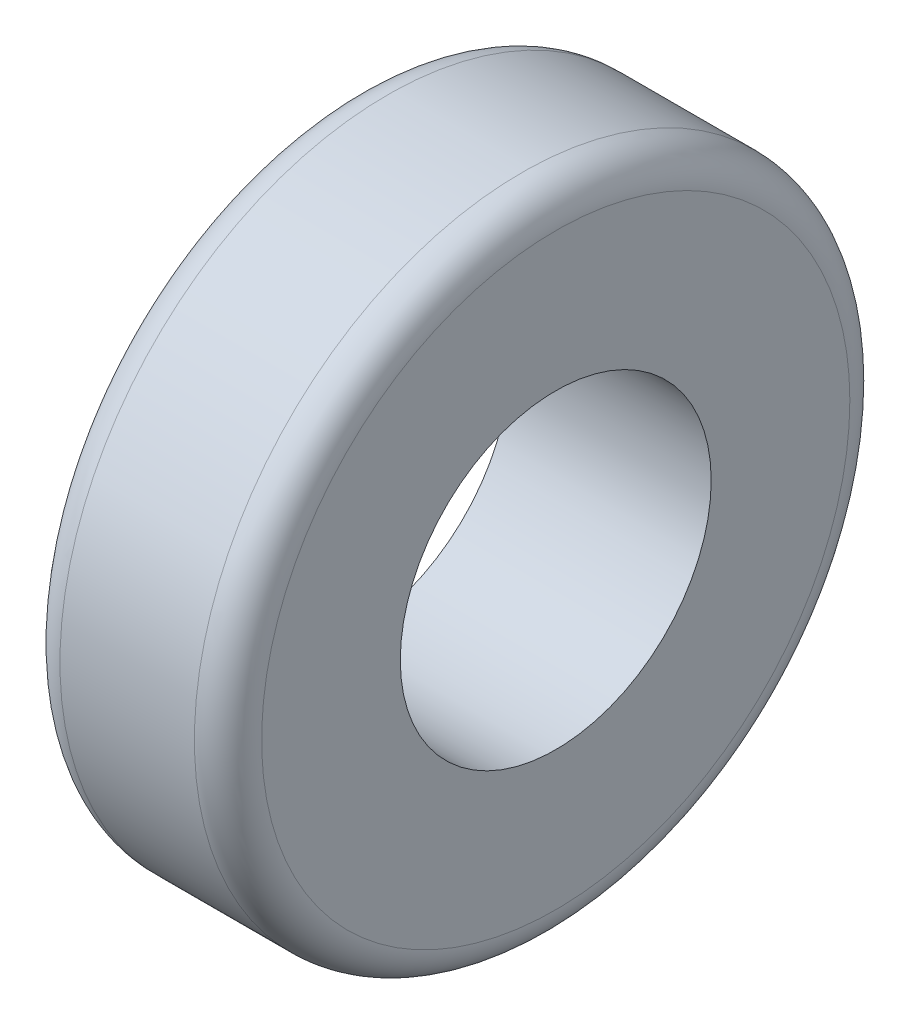
ISO-10303-21;
HEADER;
FILE_DESCRIPTION(('STEP AP214'),'2;1');
FILE_NAME('part.step','',(''),(''),'','','');
FILE_SCHEMA(('AUTOMOTIVE_DESIGN { 1 0 10303 214 1 1 1 1 }'));
ENDSEC;
DATA;
#1=APPLICATION_CONTEXT('core data for automotive mechanical design processes');
#2=APPLICATION_PROTOCOL_DEFINITION('international standard','automotive_design',2000,#1);
#3=PRODUCT_CONTEXT('',#1,'mechanical');
#4=PRODUCT('Part','Part','',(#3));
#5=PRODUCT_RELATED_PRODUCT_CATEGORY('part','',(#4));
#6=PRODUCT_DEFINITION_FORMATION('','',#4);
#7=PRODUCT_DEFINITION_CONTEXT('part definition',#1,'design');
#8=PRODUCT_DEFINITION('design','',#6,#7);
#9=PRODUCT_DEFINITION_SHAPE('','',#8);
#10=(LENGTH_UNIT() NAMED_UNIT(*) SI_UNIT(.MILLI.,.METRE.));
#11=(NAMED_UNIT(*) PLANE_ANGLE_UNIT() SI_UNIT($,.RADIAN.));
#12=(NAMED_UNIT(*) SI_UNIT($,.STERADIAN.) SOLID_ANGLE_UNIT());
#13=UNCERTAINTY_MEASURE_WITH_UNIT(LENGTH_MEASURE(1.E-05),#10,'distance_accuracy_value','');
#14=(GEOMETRIC_REPRESENTATION_CONTEXT(3) GLOBAL_UNCERTAINTY_ASSIGNED_CONTEXT((#13)) GLOBAL_UNIT_ASSIGNED_CONTEXT((#10,
#11,#12)) REPRESENTATION_CONTEXT('',''));
#15=CARTESIAN_POINT('',(0.,0.,0.));
#16=DIRECTION('',(0.,0.,1.));
#17=DIRECTION('',(1.,0.,0.));
#18=AXIS2_PLACEMENT_3D('',#15,#16,#17);
#19=CARTESIAN_POINT('',(76.2,49.7715794032449,57.8669728997994));
#20=DIRECTION('',(1.,0.,0.));
#21=DIRECTION('',(0.,0.,-1.));
#22=AXIS2_PLACEMENT_3D('',#19,#20,#21);
#23=PLANE('',#22);
#24=CARTESIAN_POINT('',(76.2,49.7715794032449,57.8669728997994));
#25=DIRECTION('',(1.,0.,0.));
#26=DIRECTION('',(0.,0.,-1.));
#27=AXIS2_PLACEMENT_3D('',#24,#25,#26);
#28=CIRCLE('',#27,111.125);
#29=CARTESIAN_POINT('',(76.2,49.7715794032449,-53.2580271002006));
#30=VERTEX_POINT('',#29);
#31=EDGE_CURVE('E10',#30,#30,#28,.T.);
#32=ORIENTED_EDGE('',*,*,#31,.T.);
#33=EDGE_LOOP('',(#32));
#34=FACE_BOUND('',#33,.T.);
#35=CARTESIAN_POINT('',(76.2,49.7715794032449,57.8669728997994));
#36=DIRECTION('',(1.,0.,0.));
#37=DIRECTION('',(0.,0.,-1.));
#38=AXIS2_PLACEMENT_3D('',#35,#36,#37);
#39=CIRCLE('',#38,58.7375);
#40=CARTESIAN_POINT('',(76.2,49.7715794032449,-0.870527100200573));
#41=VERTEX_POINT('',#40);
#42=EDGE_CURVE('E54',#41,#41,#39,.T.);
#43=ORIENTED_EDGE('',*,*,#42,.F.);
#44=EDGE_LOOP('',(#43));
#45=FACE_BOUND('',#44,.T.);
#46=ADVANCED_FACE('F34',(#34,#45),#23,.T.);
#47=CARTESIAN_POINT('',(0.,49.7715794032449,57.8669728997994));
#48=DIRECTION('',(1.,0.,0.));
#49=DIRECTION('',(0.,0.,-1.));
#50=AXIS2_PLACEMENT_3D('',#47,#48,#49);
#51=PLANE('',#50);
#52=CARTESIAN_POINT('',(0.,49.7715794032449,57.8669728997994));
#53=DIRECTION('',(1.,0.,0.));
#54=DIRECTION('',(0.,0.,-1.));
#55=AXIS2_PLACEMENT_3D('',#52,#53,#54);
#56=CIRCLE('',#55,111.125);
#57=CARTESIAN_POINT('',(0.,49.7715794032449,-53.2580271002006));
#58=VERTEX_POINT('',#57);
#59=EDGE_CURVE('E41',#58,#58,#56,.F.);
#60=ORIENTED_EDGE('',*,*,#59,.T.);
#61=EDGE_LOOP('',(#60));
#62=FACE_BOUND('',#61,.T.);
#63=CARTESIAN_POINT('',(0.,49.7715794032449,57.8669728997994));
#64=DIRECTION('',(1.,0.,0.));
#65=DIRECTION('',(0.,0.,-1.));
#66=AXIS2_PLACEMENT_3D('',#63,#64,#65);
#67=CIRCLE('',#66,58.7375);
#68=CARTESIAN_POINT('',(0.,49.7715794032449,-0.870527100200573));
#69=VERTEX_POINT('',#68);
#70=EDGE_CURVE('E55',#69,#69,#67,.T.);
#71=ORIENTED_EDGE('',*,*,#70,.T.);
#72=EDGE_LOOP('',(#71));
#73=FACE_BOUND('',#72,.T.);
#74=ADVANCED_FACE('F65',(#62,#73),#51,.F.);
#75=CARTESIAN_POINT('',(76.2,49.7715794032449,57.8669728997994));
#76=DIRECTION('',(-1.,0.,0.));
#77=DIRECTION('',(0.,0.,1.));
#78=AXIS2_PLACEMENT_3D('',#75,#76,#77);
#79=CYLINDRICAL_SURFACE('',#78,123.825);
#80=CARTESIAN_POINT('',(12.7,49.7715794032449,57.8669728997994));
#81=DIRECTION('',(1.,0.,0.));
#82=DIRECTION('',(0.,0.,-1.));
#83=AXIS2_PLACEMENT_3D('',#80,#81,#82);
#84=CIRCLE('',#83,123.825);
#85=CARTESIAN_POINT('',(12.7,49.7715794032449,-65.9580271002006));
#86=VERTEX_POINT('',#85);
#87=EDGE_CURVE('E45',#86,#86,#84,.T.);
#88=ORIENTED_EDGE('',*,*,#87,.T.);
#89=EDGE_LOOP('',(#88));
#90=FACE_BOUND('',#89,.T.);
#91=CARTESIAN_POINT('',(63.5,49.7715794032449,57.8669728997994));
#92=DIRECTION('',(1.,0.,0.));
#93=DIRECTION('',(0.,0.,-1.));
#94=AXIS2_PLACEMENT_3D('',#91,#92,#93);
#95=CIRCLE('',#94,123.825);
#96=CARTESIAN_POINT('',(63.5,49.7715794032449,-65.9580271002006));
#97=VERTEX_POINT('',#96);
#98=EDGE_CURVE('E49',#97,#97,#95,.F.);
#99=ORIENTED_EDGE('',*,*,#98,.T.);
#100=EDGE_LOOP('',(#99));
#101=FACE_BOUND('',#100,.T.);
#102=ADVANCED_FACE('F70',(#90,#101),#79,.T.);
#103=CARTESIAN_POINT('',(76.2,49.7715794032449,57.8669728997994));
#104=DIRECTION('',(-1.,0.,0.));
#105=DIRECTION('',(0.,0.,1.));
#106=AXIS2_PLACEMENT_3D('',#103,#104,#105);
#107=CYLINDRICAL_SURFACE('',#106,58.7375);
#108=ORIENTED_EDGE('',*,*,#42,.T.);
#109=EDGE_LOOP('',(#108));
#110=FACE_BOUND('',#109,.T.);
#111=ORIENTED_EDGE('',*,*,#70,.F.);
#112=EDGE_LOOP('',(#111));
#113=FACE_BOUND('',#112,.T.);
#114=ADVANCED_FACE('F61',(#110,#113),#107,.F.);
#115=CARTESIAN_POINT('',(12.7,49.7715794032449,57.8669728997994));
#116=DIRECTION('',(1.,0.,0.));
#117=DIRECTION('',(0.,0.,-1.));
#118=AXIS2_PLACEMENT_3D('',#115,#116,#117);
#119=TOROIDAL_SURFACE('',#118,111.125,12.7);
#120=ORIENTED_EDGE('',*,*,#59,.F.);
#121=EDGE_LOOP('',(#120));
#122=FACE_BOUND('',#121,.T.);
#123=ORIENTED_EDGE('',*,*,#87,.F.);
#124=EDGE_LOOP('',(#123));
#125=FACE_BOUND('',#124,.T.);
#126=ADVANCED_FACE('F76',(#122,#125),#119,.T.);
#127=CARTESIAN_POINT('',(63.5,49.7715794032449,57.8669728997994));
#128=DIRECTION('',(1.,0.,0.));
#129=DIRECTION('',(0.,0.,-1.));
#130=AXIS2_PLACEMENT_3D('',#127,#128,#129);
#131=TOROIDAL_SURFACE('',#130,111.125,12.7);
#132=ORIENTED_EDGE('',*,*,#98,.F.);
#133=EDGE_LOOP('',(#132));
#134=FACE_BOUND('',#133,.T.);
#135=ORIENTED_EDGE('',*,*,#31,.F.);
#136=EDGE_LOOP('',(#135));
#137=FACE_BOUND('',#136,.T.);
#138=ADVANCED_FACE('F36',(#134,#137),#131,.T.);
#139=CLOSED_SHELL('',(#46,#74,#102,#114,#126,#138));
#140=MANIFOLD_SOLID_BREP('B2',#139);
#141=ADVANCED_BREP_SHAPE_REPRESENTATION('',(#18,#140),#14);
#142=SHAPE_DEFINITION_REPRESENTATION(#9,#141);
ENDSEC;
END-ISO-10303-21;
